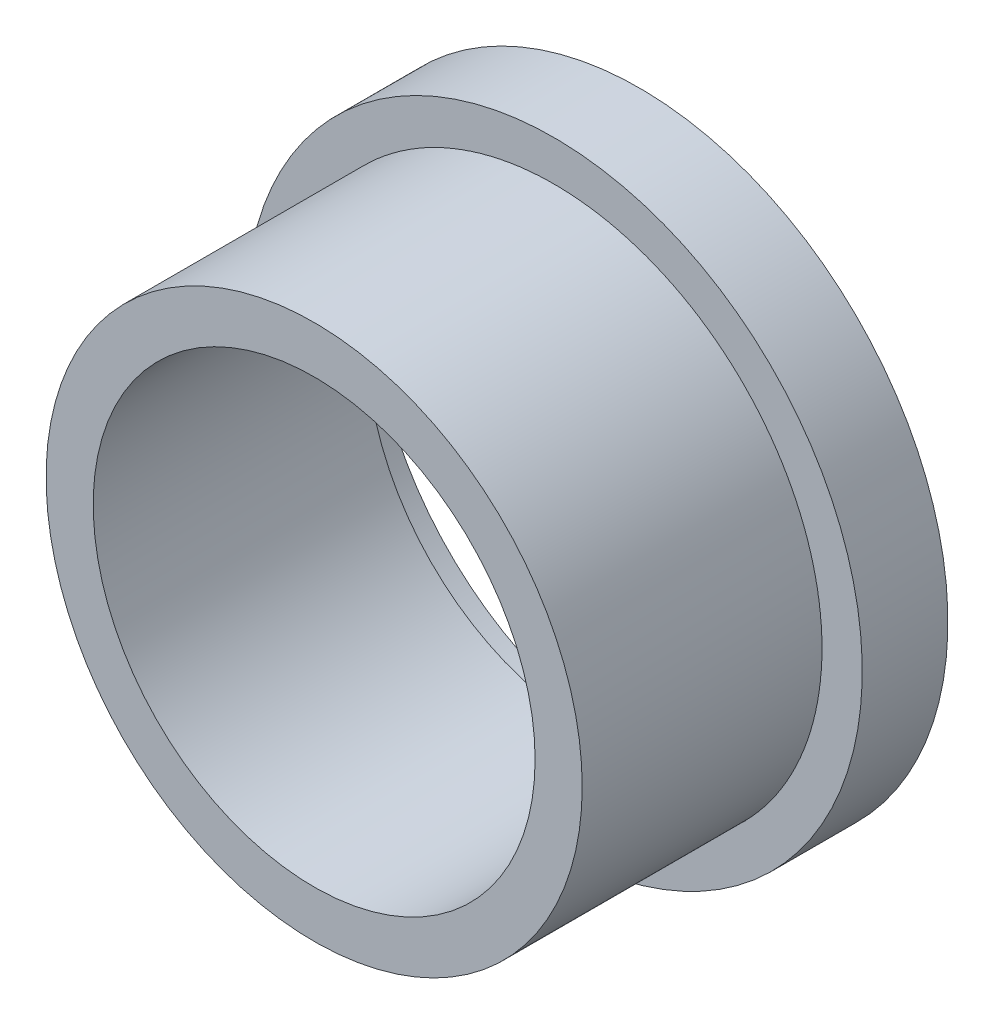
ISO-10303-21;
HEADER;
FILE_DESCRIPTION(('STEP AP214'),'2;1');
FILE_NAME('part.step','',(''),(''),'','','');
FILE_SCHEMA(('AUTOMOTIVE_DESIGN { 1 0 10303 214 1 1 1 1 }'));
ENDSEC;
DATA;
#1=APPLICATION_CONTEXT('core data for automotive mechanical design processes');
#2=APPLICATION_PROTOCOL_DEFINITION('international standard','automotive_design',2000,#1);
#3=PRODUCT_CONTEXT('',#1,'mechanical');
#4=PRODUCT('Part','Part','',(#3));
#5=PRODUCT_RELATED_PRODUCT_CATEGORY('part','',(#4));
#6=PRODUCT_DEFINITION_FORMATION('','',#4);
#7=PRODUCT_DEFINITION_CONTEXT('part definition',#1,'design');
#8=PRODUCT_DEFINITION('design','',#6,#7);
#9=PRODUCT_DEFINITION_SHAPE('','',#8);
#10=(LENGTH_UNIT() NAMED_UNIT(*) SI_UNIT(.MILLI.,.METRE.));
#11=(NAMED_UNIT(*) PLANE_ANGLE_UNIT() SI_UNIT($,.RADIAN.));
#12=(NAMED_UNIT(*) SI_UNIT($,.STERADIAN.) SOLID_ANGLE_UNIT());
#13=UNCERTAINTY_MEASURE_WITH_UNIT(LENGTH_MEASURE(1.E-05),#10,'distance_accuracy_value','');
#14=(GEOMETRIC_REPRESENTATION_CONTEXT(3) GLOBAL_UNCERTAINTY_ASSIGNED_CONTEXT((#13)) GLOBAL_UNIT_ASSIGNED_CONTEXT((#10,
#11,#12)) REPRESENTATION_CONTEXT('',''));
#15=CARTESIAN_POINT('',(0.,0.,0.));
#16=DIRECTION('',(0.,0.,1.));
#17=DIRECTION('',(1.,0.,0.));
#18=AXIS2_PLACEMENT_3D('',#15,#16,#17);
#19=CARTESIAN_POINT('',(0.,0.,1.));
#20=DIRECTION('',(0.,0.,-1.));
#21=DIRECTION('',(-1.,0.,0.));
#22=AXIS2_PLACEMENT_3D('',#19,#20,#21);
#23=CYLINDRICAL_SURFACE('',#22,9.);
#24=CARTESIAN_POINT('',(0.,0.,1.));
#25=DIRECTION('',(0.,0.,-1.));
#26=DIRECTION('',(-1.,0.,0.));
#27=AXIS2_PLACEMENT_3D('',#24,#25,#26);
#28=CIRCLE('',#27,9.);
#29=CARTESIAN_POINT('',(-9.,0.,1.));
#30=VERTEX_POINT('',#29);
#31=EDGE_CURVE('E11',#30,#30,#28,.T.);
#32=ORIENTED_EDGE('',*,*,#31,.T.);
#33=EDGE_LOOP('',(#32));
#34=FACE_BOUND('',#33,.T.);
#35=CARTESIAN_POINT('',(0.,0.,-1.5));
#36=DIRECTION('',(0.,0.,-1.));
#37=DIRECTION('',(-1.,0.,0.));
#38=AXIS2_PLACEMENT_3D('',#35,#36,#37);
#39=CIRCLE('',#38,9.);
#40=CARTESIAN_POINT('',(-9.,0.,-1.5));
#41=VERTEX_POINT('',#40);
#42=EDGE_CURVE('E67',#41,#41,#39,.T.);
#43=ORIENTED_EDGE('',*,*,#42,.F.);
#44=EDGE_LOOP('',(#43));
#45=FACE_BOUND('',#44,.T.);
#46=ADVANCED_FACE('F55',(#34,#45),#23,.T.);
#47=CARTESIAN_POINT('',(0.,0.,1.));
#48=DIRECTION('',(0.,0.,-1.));
#49=DIRECTION('',(-1.,0.,0.));
#50=AXIS2_PLACEMENT_3D('',#47,#48,#49);
#51=PLANE('',#50);
#52=CARTESIAN_POINT('',(0.,0.,1.));
#53=DIRECTION('',(0.,0.,-1.));
#54=DIRECTION('',(-1.,0.,0.));
#55=AXIS2_PLACEMENT_3D('',#52,#53,#54);
#56=CIRCLE('',#55,7.825);
#57=CARTESIAN_POINT('',(-7.825,0.,1.));
#58=VERTEX_POINT('',#57);
#59=EDGE_CURVE('E62',#58,#58,#56,.T.);
#60=ORIENTED_EDGE('',*,*,#59,.T.);
#61=EDGE_LOOP('',(#60));
#62=FACE_BOUND('',#61,.T.);
#63=ORIENTED_EDGE('',*,*,#31,.F.);
#64=EDGE_LOOP('',(#63));
#65=FACE_BOUND('',#64,.T.);
#66=ADVANCED_FACE('F87',(#62,#65),#51,.F.);
#67=CARTESIAN_POINT('',(0.,0.,1.));
#68=DIRECTION('',(0.,0.,-1.));
#69=DIRECTION('',(-1.,0.,0.));
#70=AXIS2_PLACEMENT_3D('',#67,#68,#69);
#71=CYLINDRICAL_SURFACE('',#70,7.825);
#72=ORIENTED_EDGE('',*,*,#59,.F.);
#73=EDGE_LOOP('',(#72));
#74=FACE_BOUND('',#73,.T.);
#75=CARTESIAN_POINT('',(0.,0.,-1.5));
#76=DIRECTION('',(0.,0.,-1.));
#77=DIRECTION('',(-1.,0.,0.));
#78=AXIS2_PLACEMENT_3D('',#75,#76,#77);
#79=CIRCLE('',#78,7.825);
#80=CARTESIAN_POINT('',(-7.825,0.,-1.5));
#81=VERTEX_POINT('',#80);
#82=EDGE_CURVE('E73',#81,#81,#79,.T.);
#83=ORIENTED_EDGE('',*,*,#82,.T.);
#84=EDGE_LOOP('',(#83));
#85=FACE_BOUND('',#84,.T.);
#86=ADVANCED_FACE('F79',(#74,#85),#71,.F.);
#87=CARTESIAN_POINT('',(0.,0.,-1.5));
#88=DIRECTION('',(0.,0.,-1.));
#89=DIRECTION('',(-1.,0.,0.));
#90=AXIS2_PLACEMENT_3D('',#87,#88,#89);
#91=PLANE('',#90);
#92=ORIENTED_EDGE('',*,*,#42,.T.);
#93=EDGE_LOOP('',(#92));
#94=FACE_BOUND('',#93,.T.);
#95=ORIENTED_EDGE('',*,*,#82,.F.);
#96=EDGE_LOOP('',(#95));
#97=FACE_BOUND('',#96,.T.);
#98=ADVANCED_FACE('F81',(#94,#97),#91,.T.);
#99=CLOSED_SHELL('',(#46,#66,#86,#98));
#100=MANIFOLD_SOLID_BREP('B2',#99);
#101=CARTESIAN_POINT('',(0.,0.,8.));
#102=DIRECTION('',(0.,0.,1.));
#103=DIRECTION('',(1.,0.,0.));
#104=AXIS2_PLACEMENT_3D('',#101,#102,#103);
#105=PLANE('',#104);
#106=CARTESIAN_POINT('',(0.,0.,8.));
#107=DIRECTION('',(0.,0.,1.));
#108=DIRECTION('',(1.,0.,0.));
#109=AXIS2_PLACEMENT_3D('',#106,#107,#108);
#110=CIRCLE('',#109,7.825);
#111=CARTESIAN_POINT('',(7.825,0.,8.));
#112=VERTEX_POINT('',#111);
#113=EDGE_CURVE('E54',#112,#112,#110,.T.);
#114=ORIENTED_EDGE('',*,*,#113,.T.);
#115=EDGE_LOOP('',(#114));
#116=FACE_BOUND('',#115,.T.);
#117=CARTESIAN_POINT('',(0.,0.,8.));
#118=DIRECTION('',(0.,0.,1.));
#119=DIRECTION('',(1.,0.,0.));
#120=AXIS2_PLACEMENT_3D('',#117,#118,#119);
#121=CIRCLE('',#120,6.45);
#122=CARTESIAN_POINT('',(6.45,0.,8.));
#123=VERTEX_POINT('',#122);
#124=EDGE_CURVE('E140',#123,#123,#121,.T.);
#125=ORIENTED_EDGE('',*,*,#124,.F.);
#126=EDGE_LOOP('',(#125));
#127=FACE_BOUND('',#126,.T.);
#128=ADVANCED_FACE('F125',(#116,#127),#105,.T.);
#129=CARTESIAN_POINT('',(0.,0.,0.));
#130=DIRECTION('',(0.,0.,1.));
#131=DIRECTION('',(1.,0.,0.));
#132=AXIS2_PLACEMENT_3D('',#129,#130,#131);
#133=PLANE('',#132);
#134=CARTESIAN_POINT('',(0.,0.,0.));
#135=DIRECTION('',(0.,0.,1.));
#136=DIRECTION('',(1.,0.,0.));
#137=AXIS2_PLACEMENT_3D('',#134,#135,#136);
#138=CIRCLE('',#137,7.825);
#139=CARTESIAN_POINT('',(7.825,0.,0.));
#140=VERTEX_POINT('',#139);
#141=EDGE_CURVE('E129',#140,#140,#138,.T.);
#142=ORIENTED_EDGE('',*,*,#141,.F.);
#143=EDGE_LOOP('',(#142));
#144=FACE_BOUND('',#143,.T.);
#145=CARTESIAN_POINT('',(0.,0.,0.));
#146=DIRECTION('',(0.,0.,1.));
#147=DIRECTION('',(1.,0.,0.));
#148=AXIS2_PLACEMENT_3D('',#145,#146,#147);
#149=CIRCLE('',#148,6.45);
#150=CARTESIAN_POINT('',(6.45,0.,0.));
#151=VERTEX_POINT('',#150);
#152=EDGE_CURVE('E142',#151,#151,#149,.T.);
#153=ORIENTED_EDGE('',*,*,#152,.T.);
#154=EDGE_LOOP('',(#153));
#155=FACE_BOUND('',#154,.T.);
#156=ADVANCED_FACE('F154',(#144,#155),#133,.F.);
#157=CARTESIAN_POINT('',(0.,0.,8.));
#158=DIRECTION('',(0.,0.,-1.));
#159=DIRECTION('',(-1.,0.,0.));
#160=AXIS2_PLACEMENT_3D('',#157,#158,#159);
#161=CYLINDRICAL_SURFACE('',#160,7.825);
#162=ORIENTED_EDGE('',*,*,#113,.F.);
#163=EDGE_LOOP('',(#162));
#164=FACE_BOUND('',#163,.T.);
#165=ORIENTED_EDGE('',*,*,#141,.T.);
#166=EDGE_LOOP('',(#165));
#167=FACE_BOUND('',#166,.T.);
#168=ADVANCED_FACE('F127',(#164,#167),#161,.T.);
#169=CARTESIAN_POINT('',(0.,0.,8.));
#170=DIRECTION('',(0.,0.,-1.));
#171=DIRECTION('',(-1.,0.,0.));
#172=AXIS2_PLACEMENT_3D('',#169,#170,#171);
#173=CYLINDRICAL_SURFACE('',#172,6.45);
#174=ORIENTED_EDGE('',*,*,#124,.T.);
#175=EDGE_LOOP('',(#174));
#176=FACE_BOUND('',#175,.T.);
#177=ORIENTED_EDGE('',*,*,#152,.F.);
#178=EDGE_LOOP('',(#177));
#179=FACE_BOUND('',#178,.T.);
#180=ADVANCED_FACE('F150',(#176,#179),#173,.F.);
#181=CLOSED_SHELL('',(#128,#156,#168,#180));
#182=MANIFOLD_SOLID_BREP('B6',#181);
#183=ADVANCED_BREP_SHAPE_REPRESENTATION('',(#18,#100,#182),#14);
#184=SHAPE_DEFINITION_REPRESENTATION(#9,#183);
ENDSEC;
END-ISO-10303-21;
